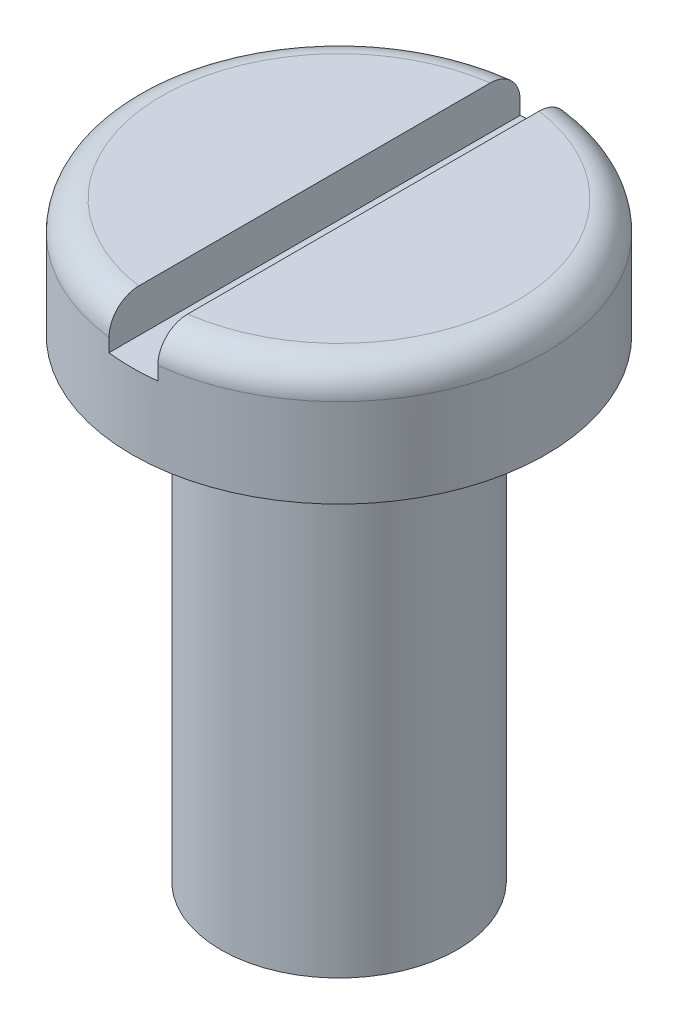
ISO-10303-21;
HEADER;
FILE_DESCRIPTION(('STEP AP214'),'2;1');
FILE_NAME('part.step','',(''),(''),'','','');
FILE_SCHEMA(('AUTOMOTIVE_DESIGN { 1 0 10303 214 1 1 1 1 }'));
ENDSEC;
DATA;
#1=APPLICATION_CONTEXT('core data for automotive mechanical design processes');
#2=APPLICATION_PROTOCOL_DEFINITION('international standard','automotive_design',2000,#1);
#3=PRODUCT_CONTEXT('',#1,'mechanical');
#4=PRODUCT('Part','Part','',(#3));
#5=PRODUCT_RELATED_PRODUCT_CATEGORY('part','',(#4));
#6=PRODUCT_DEFINITION_FORMATION('','',#4);
#7=PRODUCT_DEFINITION_CONTEXT('part definition',#1,'design');
#8=PRODUCT_DEFINITION('design','',#6,#7);
#9=PRODUCT_DEFINITION_SHAPE('','',#8);
#10=(LENGTH_UNIT() NAMED_UNIT(*) SI_UNIT(.MILLI.,.METRE.));
#11=(NAMED_UNIT(*) PLANE_ANGLE_UNIT() SI_UNIT($,.RADIAN.));
#12=(NAMED_UNIT(*) SI_UNIT($,.STERADIAN.) SOLID_ANGLE_UNIT());
#13=UNCERTAINTY_MEASURE_WITH_UNIT(LENGTH_MEASURE(1.E-05),#10,'distance_accuracy_value','');
#14=(GEOMETRIC_REPRESENTATION_CONTEXT(3) GLOBAL_UNCERTAINTY_ASSIGNED_CONTEXT((#13)) GLOBAL_UNIT_ASSIGNED_CONTEXT((#10,
#11,#12)) REPRESENTATION_CONTEXT('',''));
#15=CARTESIAN_POINT('',(0.,0.,0.));
#16=DIRECTION('',(0.,0.,1.));
#17=DIRECTION('',(1.,0.,0.));
#18=AXIS2_PLACEMENT_3D('',#15,#16,#17);
#19=CARTESIAN_POINT('',(0.,0.,0.));
#20=DIRECTION('',(0.,1.,0.));
#21=DIRECTION('',(0.,0.,1.));
#22=AXIS2_PLACEMENT_3D('',#19,#20,#21);
#23=PLANE('',#22);
#24=DIRECTION('',(0.,0.,-1.));
#25=VECTOR('',#24,1.);
#26=CARTESIAN_POINT('',(0.412496722450363,0.,0.));
#27=LINE('',#26,#25);
#28=CARTESIAN_POINT('',(0.412496722450363,0.,2.97150575533141));
#29=VERTEX_POINT('',#28);
#30=CARTESIAN_POINT('',(0.412496722450363,0.,-2.97150575533141));
#31=VERTEX_POINT('',#30);
#32=EDGE_CURVE('E143',#29,#31,#27,.T.);
#33=ORIENTED_EDGE('',*,*,#32,.F.);
#34=CARTESIAN_POINT('',(0.,0.,0.));
#35=DIRECTION('',(0.,1.,0.));
#36=DIRECTION('',(0.,0.,1.));
#37=AXIS2_PLACEMENT_3D('',#34,#35,#36);
#38=CIRCLE('',#37,3.);
#39=EDGE_CURVE('E111',#29,#31,#38,.T.);
#40=ORIENTED_EDGE('',*,*,#39,.T.);
#41=EDGE_LOOP('',(#33,#40));
#42=FACE_BOUND('',#41,.T.);
#43=ADVANCED_FACE('F42',(#42),#23,.T.);
#44=CARTESIAN_POINT('',(0.,-2.,0.));
#45=DIRECTION('',(0.,1.,0.));
#46=DIRECTION('',(0.,0.,1.));
#47=AXIS2_PLACEMENT_3D('',#44,#45,#46);
#48=CYLINDRICAL_SURFACE('',#47,3.5);
#49=DIRECTION('',(0.,1.,0.));
#50=VECTOR('',#49,1.);
#51=CARTESIAN_POINT('',(0.412496722450363,-2.,-3.47560735037313));
#52=LINE('',#51,#50);
#53=CARTESIAN_POINT('',(0.412496722450363,-0.5,-3.47560735037313));
#54=VERTEX_POINT('',#53);
#55=CARTESIAN_POINT('',(0.412496722450363,-0.726761353624342,-3.47560735037313));
#56=VERTEX_POINT('',#55);
#57=EDGE_CURVE('E130',#54,#56,#52,.F.);
#58=ORIENTED_EDGE('',*,*,#57,.F.);
#59=CARTESIAN_POINT('',(0.,-0.5,0.));
#60=DIRECTION('',(0.,1.,0.));
#61=DIRECTION('',(0.,0.,1.));
#62=AXIS2_PLACEMENT_3D('',#59,#60,#61);
#63=CIRCLE('',#62,3.5);
#64=CARTESIAN_POINT('',(0.412496722450363,-0.5,3.47560735037313));
#65=VERTEX_POINT('',#64);
#66=EDGE_CURVE('E199',#54,#65,#63,.F.);
#67=ORIENTED_EDGE('',*,*,#66,.T.);
#68=DIRECTION('',(0.,1.,0.));
#69=VECTOR('',#68,1.);
#70=CARTESIAN_POINT('',(0.412496722450363,-2.,3.47560735037313));
#71=LINE('',#70,#69);
#72=CARTESIAN_POINT('',(0.412496722450363,-0.726761353624342,3.47560735037313));
#73=VERTEX_POINT('',#72);
#74=EDGE_CURVE('E124',#73,#65,#71,.T.);
#75=ORIENTED_EDGE('',*,*,#74,.F.);
#76=CARTESIAN_POINT('',(0.,-0.726761353624342,0.));
#77=DIRECTION('',(0.,-1.,0.));
#78=DIRECTION('',(0.,0.,-1.));
#79=AXIS2_PLACEMENT_3D('',#76,#77,#78);
#80=CIRCLE('',#79,3.5);
#81=CARTESIAN_POINT('',(-0.412496722450363,-0.726761353624342,3.47560735037313));
#82=VERTEX_POINT('',#81);
#83=EDGE_CURVE('E112',#82,#73,#80,.F.);
#84=ORIENTED_EDGE('',*,*,#83,.F.);
#85=DIRECTION('',(0.,1.,0.));
#86=VECTOR('',#85,1.);
#87=CARTESIAN_POINT('',(-0.412496722450363,-2.,3.47560735037313));
#88=LINE('',#87,#86);
#89=CARTESIAN_POINT('',(-0.412496722450363,-0.5,3.47560735037313));
#90=VERTEX_POINT('',#89);
#91=EDGE_CURVE('E117',#90,#82,#88,.F.);
#92=ORIENTED_EDGE('',*,*,#91,.F.);
#93=CARTESIAN_POINT('',(0.,-0.5,0.));
#94=DIRECTION('',(0.,1.,0.));
#95=DIRECTION('',(0.,0.,1.));
#96=AXIS2_PLACEMENT_3D('',#93,#94,#95);
#97=CIRCLE('',#96,3.5);
#98=CARTESIAN_POINT('',(-0.412496722450363,-0.5,-3.47560735037313));
#99=VERTEX_POINT('',#98);
#100=EDGE_CURVE('E122',#90,#99,#97,.F.);
#101=ORIENTED_EDGE('',*,*,#100,.T.);
#102=DIRECTION('',(0.,1.,0.));
#103=VECTOR('',#102,1.);
#104=CARTESIAN_POINT('',(-0.412496722450363,-2.,-3.47560735037313));
#105=LINE('',#104,#103);
#106=CARTESIAN_POINT('',(-0.412496722450363,-0.726761353624342,-3.47560735037313));
#107=VERTEX_POINT('',#106);
#108=EDGE_CURVE('E115',#107,#99,#105,.T.);
#109=ORIENTED_EDGE('',*,*,#108,.F.);
#110=EDGE_CURVE('E102',#56,#107,#80,.F.);
#111=ORIENTED_EDGE('',*,*,#110,.F.);
#112=EDGE_LOOP('',(#58,#67,#75,#84,#92,#101,#109,#111));
#113=FACE_BOUND('',#112,.T.);
#114=CARTESIAN_POINT('',(0.,-2.,0.));
#115=DIRECTION('',(0.,1.,0.));
#116=DIRECTION('',(0.,0.,1.));
#117=AXIS2_PLACEMENT_3D('',#114,#115,#116);
#118=CIRCLE('',#117,3.5);
#119=CARTESIAN_POINT('',(0.,-2.,3.5));
#120=VERTEX_POINT('',#119);
#121=EDGE_CURVE('E138',#120,#120,#118,.T.);
#122=ORIENTED_EDGE('',*,*,#121,.T.);
#123=EDGE_LOOP('',(#122));
#124=FACE_BOUND('',#123,.T.);
#125=ADVANCED_FACE('F120',(#113,#124),#48,.T.);
#126=CARTESIAN_POINT('',(0.,-2.,0.));
#127=DIRECTION('',(0.,1.,0.));
#128=DIRECTION('',(0.,0.,1.));
#129=AXIS2_PLACEMENT_3D('',#126,#127,#128);
#130=PLANE('',#129);
#131=CARTESIAN_POINT('',(0.,-2.,0.));
#132=DIRECTION('',(0.,1.,0.));
#133=DIRECTION('',(0.,0.,1.));
#134=AXIS2_PLACEMENT_3D('',#131,#132,#133);
#135=CIRCLE('',#134,2.);
#136=CARTESIAN_POINT('',(0.,-2.,2.));
#137=VERTEX_POINT('',#136);
#138=EDGE_CURVE('E135',#137,#137,#135,.T.);
#139=ORIENTED_EDGE('',*,*,#138,.T.);
#140=EDGE_LOOP('',(#139));
#141=FACE_BOUND('',#140,.T.);
#142=ORIENTED_EDGE('',*,*,#121,.F.);
#143=EDGE_LOOP('',(#142));
#144=FACE_BOUND('',#143,.T.);
#145=ADVANCED_FACE('F181',(#141,#144),#130,.F.);
#146=DIRECTION('',(0.,0.,1.));
#147=VECTOR('',#146,1.);
#148=CARTESIAN_POINT('',(-0.412496722450363,0.,0.));
#149=LINE('',#148,#147);
#150=CARTESIAN_POINT('',(-0.412496722450363,0.,-2.97150575533141));
#151=VERTEX_POINT('',#150);
#152=CARTESIAN_POINT('',(-0.412496722450363,0.,2.97150575533141));
#153=VERTEX_POINT('',#152);
#154=EDGE_CURVE('E141',#151,#153,#149,.T.);
#155=ORIENTED_EDGE('',*,*,#154,.F.);
#156=CARTESIAN_POINT('',(0.,0.,0.));
#157=DIRECTION('',(0.,1.,0.));
#158=DIRECTION('',(0.,0.,1.));
#159=AXIS2_PLACEMENT_3D('',#156,#157,#158);
#160=CIRCLE('',#159,3.);
#161=EDGE_CURVE('E200',#151,#153,#160,.T.);
#162=ORIENTED_EDGE('',*,*,#161,.T.);
#163=EDGE_LOOP('',(#155,#162));
#164=FACE_BOUND('',#163,.T.);
#165=ADVANCED_FACE('F179',(#164),#23,.T.);
#166=CARTESIAN_POINT('',(0.,-10.,0.));
#167=DIRECTION('',(0.,1.,0.));
#168=DIRECTION('',(0.,0.,1.));
#169=AXIS2_PLACEMENT_3D('',#166,#167,#168);
#170=CYLINDRICAL_SURFACE('',#169,2.);
#171=CARTESIAN_POINT('',(0.,-10.,0.));
#172=DIRECTION('',(0.,1.,0.));
#173=DIRECTION('',(0.,0.,1.));
#174=AXIS2_PLACEMENT_3D('',#171,#172,#173);
#175=CIRCLE('',#174,2.);
#176=CARTESIAN_POINT('',(0.,-10.,2.));
#177=VERTEX_POINT('',#176);
#178=EDGE_CURVE('E132',#177,#177,#175,.T.);
#179=ORIENTED_EDGE('',*,*,#178,.T.);
#180=EDGE_LOOP('',(#179));
#181=FACE_BOUND('',#180,.T.);
#182=ORIENTED_EDGE('',*,*,#138,.F.);
#183=EDGE_LOOP('',(#182));
#184=FACE_BOUND('',#183,.T.);
#185=ADVANCED_FACE('F175',(#181,#184),#170,.T.);
#186=CARTESIAN_POINT('',(0.,-10.,0.));
#187=DIRECTION('',(0.,1.,0.));
#188=DIRECTION('',(0.,0.,1.));
#189=AXIS2_PLACEMENT_3D('',#186,#187,#188);
#190=PLANE('',#189);
#191=ORIENTED_EDGE('',*,*,#178,.F.);
#192=EDGE_LOOP('',(#191));
#193=FACE_BOUND('',#192,.T.);
#194=ADVANCED_FACE('F168',(#193),#190,.F.);
#195=CARTESIAN_POINT('',(0.412496722450363,0.726761353624342,-3.5));
#196=DIRECTION('',(1.,0.,0.));
#197=DIRECTION('',(0.,0.,-1.));
#198=AXIS2_PLACEMENT_3D('',#195,#196,#197);
#199=PLANE('',#198);
#200=ORIENTED_EDGE('',*,*,#32,.T.);
#201=CARTESIAN_POINT('',(0.412496722450363,0.,-2.97150575533141));
#202=CARTESIAN_POINT('',(0.412496722450363,2.34193448147097E-05,-3.0000500215188));
#203=CARTESIAN_POINT('',(0.412496722450363,-0.00239678232288835,-3.02858978404403));
#204=CARTESIAN_POINT('',(0.412496722450363,-0.0119626180426814,-3.08485277119448));
#205=CARTESIAN_POINT('',(0.412496722450363,-0.0191060029766237,-3.11257637790241));
#206=CARTESIAN_POINT('',(0.412496722450363,-0.0379626070024103,-3.16644513689667));
#207=CARTESIAN_POINT('',(0.412496722450363,-0.0496786979602847,-3.19258928527229));
#208=CARTESIAN_POINT('',(0.412496722450363,-0.0773521350162343,-3.24251874509172));
#209=CARTESIAN_POINT('',(0.412496722450363,-0.0933083119024124,-3.26630470433175));
#210=CARTESIAN_POINT('',(0.412496722450363,-0.128928326048731,-3.31071259627897));
#211=CARTESIAN_POINT('',(0.412496722450363,-0.148572401997617,-3.33135037641038));
#212=CARTESIAN_POINT('',(0.412496722450363,-0.191075944219881,-3.36900780327456));
#213=CARTESIAN_POINT('',(0.412496722450363,-0.213936008725238,-3.386026775361));
#214=CARTESIAN_POINT('',(0.412496722450363,-0.262027741744089,-3.41582030300094));
#215=CARTESIAN_POINT('',(0.412496722450363,-0.287240008591262,-3.42862621674992));
#216=CARTESIAN_POINT('',(0.412496722450363,-0.339459756749062,-3.44978637750794));
#217=CARTESIAN_POINT('',(0.412496722450363,-0.366465982989534,-3.4581437006546));
#218=CARTESIAN_POINT('',(0.412496722450363,-0.41138107027103,-3.46796136123215));
#219=CARTESIAN_POINT('',(0.412496722450363,-0.428995199066905,-3.47082696873576));
#220=CARTESIAN_POINT('',(0.412496722450363,-0.464403629339462,-3.47464956878223));
#221=CARTESIAN_POINT('',(0.412496722450363,-0.482197634825912,-3.47560930392772));
#222=CARTESIAN_POINT('',(0.412496722450363,-0.5,-3.47560735037313));
#223=B_SPLINE_CURVE_WITH_KNOTS('',3,(#201,#202,#203,#204,#205,#206,#207,#208,#209,#210,#211,
#212,#213,#214,#215,#216,#217,#218,#219,#220,#221,#222),.UNSPECIFIED.,.F.,.F.,(4,2,2,2,2,2,2,2,
2,2,4),(0.,0.0855242112411407,0.171007726272375,0.256545015430686,0.342058741948448,
0.42712669285464,0.512210488912084,0.596645862365883,0.681022773853522,0.734464670532709,
0.787829606965543),.UNSPECIFIED.);
#224=EDGE_CURVE('E155',#31,#54,#223,.T.);
#225=ORIENTED_EDGE('',*,*,#224,.T.);
#226=ORIENTED_EDGE('',*,*,#57,.T.);
#227=DIRECTION('',(0.,0.,1.));
#228=VECTOR('',#227,1.);
#229=CARTESIAN_POINT('',(0.412496722450363,-0.726761353624342,-3.5));
#230=LINE('',#229,#228);
#231=EDGE_CURVE('E107',#56,#73,#230,.T.);
#232=ORIENTED_EDGE('',*,*,#231,.T.);
#233=ORIENTED_EDGE('',*,*,#74,.T.);
#234=CARTESIAN_POINT('',(0.412496722450363,-0.5,3.47560735037313));
#235=CARTESIAN_POINT('',(0.412496722450363,-0.472019103558278,3.47563194854771));
#236=CARTESIAN_POINT('',(0.412496722450363,-0.444046352578396,3.47324358179606));
#237=CARTESIAN_POINT('',(0.412496722450363,-0.388920482115656,3.46382360583984));
#238=CARTESIAN_POINT('',(0.412496722450363,-0.361766597289876,3.45679648230468));
#239=CARTESIAN_POINT('',(0.412496722450363,-0.309013668901676,3.43827713979618));
#240=CARTESIAN_POINT('',(0.412496722450363,-0.28341528448881,3.4267830429737));
#241=CARTESIAN_POINT('',(0.412496722450363,-0.23450743279406,3.39967516557439));
#242=CARTESIAN_POINT('',(0.412496722450363,-0.211197675889428,3.38406190719634));
#243=CARTESIAN_POINT('',(0.412496722450363,-0.16745035473705,3.349116132449));
#244=CARTESIAN_POINT('',(0.412496722450363,-0.147020950940692,3.32977340252199));
#245=CARTESIAN_POINT('',(0.412496722450363,-0.109669728198272,3.28794912989599));
#246=CARTESIAN_POINT('',(0.412496722450363,-0.0927486057005499,3.26546696545006));
#247=CARTESIAN_POINT('',(0.412496722450363,-0.062773176154718,3.21784404258561));
#248=CARTESIAN_POINT('',(0.412496722450363,-0.0497462349819121,3.19268607943755));
#249=CARTESIAN_POINT('',(0.412496722450363,-0.0280688449009618,3.14055571736259));
#250=CARTESIAN_POINT('',(0.412496722450363,-0.0194164415739066,3.11358413482239));
#251=CARTESIAN_POINT('',(0.412496722450363,-0.00872008434021884,3.06731114512185));
#252=CARTESIAN_POINT('',(0.412496722450363,-0.00545135175855717,3.04828339290833));
#253=CARTESIAN_POINT('',(0.412496722450363,-0.00109150489960968,3.01000804132988));
#254=CARTESIAN_POINT('',(0.412496722450363,2.76614653736961E-06,2.99076080152244));
#255=CARTESIAN_POINT('',(0.412496722450363,0.,2.97150575533141));
#256=B_SPLINE_CURVE_WITH_KNOTS('',3,(#234,#235,#236,#237,#238,#239,#240,#241,#242,#243,#244,
#245,#246,#247,#248,#249,#250,#251,#252,#253,#254,#255),.UNSPECIFIED.,.F.,.F.,(4,2,2,2,2,2,2,2,
2,2,4),(0.,0.0838290748542537,0.167577205659477,0.251360581082921,0.335133340129432,
0.419138864893576,0.503161050125819,0.587760513450155,0.672322146670002,0.730124868002794,
0.78784361290041),.UNSPECIFIED.);
#257=EDGE_CURVE('E148',#65,#29,#256,.T.);
#258=ORIENTED_EDGE('',*,*,#257,.T.);
#259=EDGE_LOOP('',(#200,#225,#226,#232,#233,#258));
#260=FACE_BOUND('',#259,.T.);
#261=ADVANCED_FACE('F164',(#260),#199,.F.);
#262=CARTESIAN_POINT('',(-0.412496722450363,-0.726761353624342,-3.5));
#263=DIRECTION('',(0.,-1.,0.));
#264=DIRECTION('',(0.,0.,-1.));
#265=AXIS2_PLACEMENT_3D('',#262,#263,#264);
#266=PLANE('',#265);
#267=DIRECTION('',(0.,0.,1.));
#268=VECTOR('',#267,1.);
#269=CARTESIAN_POINT('',(-0.412496722450363,-0.726761353624342,-3.5));
#270=LINE('',#269,#268);
#271=EDGE_CURVE('E105',#107,#82,#270,.T.);
#272=ORIENTED_EDGE('',*,*,#271,.T.);
#273=ORIENTED_EDGE('',*,*,#83,.T.);
#274=ORIENTED_EDGE('',*,*,#231,.F.);
#275=ORIENTED_EDGE('',*,*,#110,.T.);
#276=EDGE_LOOP('',(#272,#273,#274,#275));
#277=FACE_BOUND('',#276,.T.);
#278=ADVANCED_FACE('F104',(#277),#266,.F.);
#279=CARTESIAN_POINT('',(-0.412496722450363,0.726761353624342,-3.5));
#280=DIRECTION('',(-1.,0.,0.));
#281=DIRECTION('',(0.,0.,1.));
#282=AXIS2_PLACEMENT_3D('',#279,#280,#281);
#283=PLANE('',#282);
#284=ORIENTED_EDGE('',*,*,#154,.T.);
#285=CARTESIAN_POINT('',(-0.412496722450363,0.,2.97150575533141));
#286=CARTESIAN_POINT('',(-0.412496722450363,2.34193448147097E-05,3.0000500215188));
#287=CARTESIAN_POINT('',(-0.412496722450363,-0.00239678232288835,3.02858978404403));
#288=CARTESIAN_POINT('',(-0.412496722450363,-0.0119626180426814,3.08485277119448));
#289=CARTESIAN_POINT('',(-0.412496722450363,-0.0191060029766237,3.11257637790241));
#290=CARTESIAN_POINT('',(-0.412496722450363,-0.0379626070024103,3.16644513689667));
#291=CARTESIAN_POINT('',(-0.412496722450363,-0.0496786979602847,3.19258928527229));
#292=CARTESIAN_POINT('',(-0.412496722450363,-0.0773521350162343,3.24251874509172));
#293=CARTESIAN_POINT('',(-0.412496722450363,-0.0933083119024124,3.26630470433175));
#294=CARTESIAN_POINT('',(-0.412496722450363,-0.128928326048731,3.31071259627897));
#295=CARTESIAN_POINT('',(-0.412496722450363,-0.148572401997617,3.33135037641038));
#296=CARTESIAN_POINT('',(-0.412496722450363,-0.191075944219881,3.36900780327456));
#297=CARTESIAN_POINT('',(-0.412496722450363,-0.213936008725238,3.386026775361));
#298=CARTESIAN_POINT('',(-0.412496722450363,-0.262027741744089,3.41582030300094));
#299=CARTESIAN_POINT('',(-0.412496722450363,-0.287240008591262,3.42862621674992));
#300=CARTESIAN_POINT('',(-0.412496722450363,-0.339459756749062,3.44978637750794));
#301=CARTESIAN_POINT('',(-0.412496722450363,-0.366465982989534,3.4581437006546));
#302=CARTESIAN_POINT('',(-0.412496722450363,-0.41138107027103,3.46796136123215));
#303=CARTESIAN_POINT('',(-0.412496722450363,-0.428995199066905,3.47082696873576));
#304=CARTESIAN_POINT('',(-0.412496722450363,-0.464403629339462,3.47464956878223));
#305=CARTESIAN_POINT('',(-0.412496722450363,-0.482197634825912,3.47560930392772));
#306=CARTESIAN_POINT('',(-0.412496722450363,-0.5,3.47560735037313));
#307=B_SPLINE_CURVE_WITH_KNOTS('',3,(#285,#286,#287,#288,#289,#290,#291,#292,#293,#294,#295,
#296,#297,#298,#299,#300,#301,#302,#303,#304,#305,#306),.UNSPECIFIED.,.F.,.F.,(4,2,2,2,2,2,2,2,
2,2,4),(0.,0.0855242112411407,0.171007726272375,0.256545015430686,0.342058741948448,
0.42712669285464,0.512210488912084,0.596645862365883,0.681022773853522,0.734464670532709,
0.787829606965543),.UNSPECIFIED.);
#308=EDGE_CURVE('E11',#153,#90,#307,.T.);
#309=ORIENTED_EDGE('',*,*,#308,.T.);
#310=ORIENTED_EDGE('',*,*,#91,.T.);
#311=ORIENTED_EDGE('',*,*,#271,.F.);
#312=ORIENTED_EDGE('',*,*,#108,.T.);
#313=CARTESIAN_POINT('',(-0.412496722450363,-0.5,-3.47560735037313));
#314=CARTESIAN_POINT('',(-0.412496722450363,-0.472019103558278,-3.47563194854771));
#315=CARTESIAN_POINT('',(-0.412496722450363,-0.444046352578396,-3.47324358179606));
#316=CARTESIAN_POINT('',(-0.412496722450363,-0.388920482115656,-3.46382360583984));
#317=CARTESIAN_POINT('',(-0.412496722450363,-0.361766597289876,-3.45679648230468));
#318=CARTESIAN_POINT('',(-0.412496722450363,-0.309013668901676,-3.43827713979618));
#319=CARTESIAN_POINT('',(-0.412496722450363,-0.28341528448881,-3.4267830429737));
#320=CARTESIAN_POINT('',(-0.412496722450363,-0.23450743279406,-3.39967516557439));
#321=CARTESIAN_POINT('',(-0.412496722450363,-0.211197675889428,-3.38406190719634));
#322=CARTESIAN_POINT('',(-0.412496722450363,-0.16745035473705,-3.349116132449));
#323=CARTESIAN_POINT('',(-0.412496722450363,-0.147020950940692,-3.32977340252199));
#324=CARTESIAN_POINT('',(-0.412496722450363,-0.109669728198272,-3.28794912989599));
#325=CARTESIAN_POINT('',(-0.412496722450363,-0.0927486057005499,-3.26546696545006));
#326=CARTESIAN_POINT('',(-0.412496722450363,-0.062773176154718,-3.21784404258561));
#327=CARTESIAN_POINT('',(-0.412496722450363,-0.0497462349819121,-3.19268607943755));
#328=CARTESIAN_POINT('',(-0.412496722450363,-0.0280688449009618,-3.14055571736259));
#329=CARTESIAN_POINT('',(-0.412496722450363,-0.0194164415739066,-3.11358413482239));
#330=CARTESIAN_POINT('',(-0.412496722450363,-0.00872008434021884,-3.06731114512185));
#331=CARTESIAN_POINT('',(-0.412496722450363,-0.00545135175855717,-3.04828339290833));
#332=CARTESIAN_POINT('',(-0.412496722450363,-0.00109150489960968,-3.01000804132988));
#333=CARTESIAN_POINT('',(-0.412496722450363,2.76614653736961E-06,-2.99076080152244));
#334=CARTESIAN_POINT('',(-0.412496722450363,0.,-2.97150575533141));
#335=B_SPLINE_CURVE_WITH_KNOTS('',3,(#313,#314,#315,#316,#317,#318,#319,#320,#321,#322,#323,
#324,#325,#326,#327,#328,#329,#330,#331,#332,#333,#334),.UNSPECIFIED.,.F.,.F.,(4,2,2,2,2,2,2,2,
2,2,4),(0.,0.0838290748542537,0.167577205659477,0.251360581082921,0.335133340129432,
0.419138864893576,0.503161050125819,0.587760513450155,0.672322146670002,0.730124868002794,
0.78784361290041),.UNSPECIFIED.);
#336=EDGE_CURVE('E56',#99,#151,#335,.T.);
#337=ORIENTED_EDGE('',*,*,#336,.T.);
#338=EDGE_LOOP('',(#284,#309,#310,#311,#312,#337));
#339=FACE_BOUND('',#338,.T.);
#340=ADVANCED_FACE('F114',(#339),#283,.F.);
#341=CARTESIAN_POINT('',(0.,-0.5,0.));
#342=DIRECTION('',(0.,1.,0.));
#343=DIRECTION('',(0.,0.,1.));
#344=AXIS2_PLACEMENT_3D('',#341,#342,#343);
#345=TOROIDAL_SURFACE('',#344,3.,0.5);
#346=ORIENTED_EDGE('',*,*,#257,.F.);
#347=ORIENTED_EDGE('',*,*,#66,.F.);
#348=ORIENTED_EDGE('',*,*,#224,.F.);
#349=ORIENTED_EDGE('',*,*,#39,.F.);
#350=EDGE_LOOP('',(#346,#347,#348,#349));
#351=FACE_BOUND('',#350,.T.);
#352=ADVANCED_FACE('F161',(#351),#345,.T.);
#353=CARTESIAN_POINT('',(0.,-0.5,0.));
#354=DIRECTION('',(0.,1.,0.));
#355=DIRECTION('',(0.,0.,1.));
#356=AXIS2_PLACEMENT_3D('',#353,#354,#355);
#357=TOROIDAL_SURFACE('',#356,3.,0.5);
#358=ORIENTED_EDGE('',*,*,#336,.F.);
#359=ORIENTED_EDGE('',*,*,#100,.F.);
#360=ORIENTED_EDGE('',*,*,#308,.F.);
#361=ORIENTED_EDGE('',*,*,#161,.F.);
#362=EDGE_LOOP('',(#358,#359,#360,#361));
#363=FACE_BOUND('',#362,.T.);
#364=ADVANCED_FACE('F44',(#363),#357,.T.);
#365=CLOSED_SHELL('',(#43,#125,#145,#165,#185,#194,#261,#278,#340,#352,#364));
#366=MANIFOLD_SOLID_BREP('B2',#365);
#367=ADVANCED_BREP_SHAPE_REPRESENTATION('',(#18,#366),#14);
#368=SHAPE_DEFINITION_REPRESENTATION(#9,#367);
ENDSEC;
END-ISO-10303-21;
